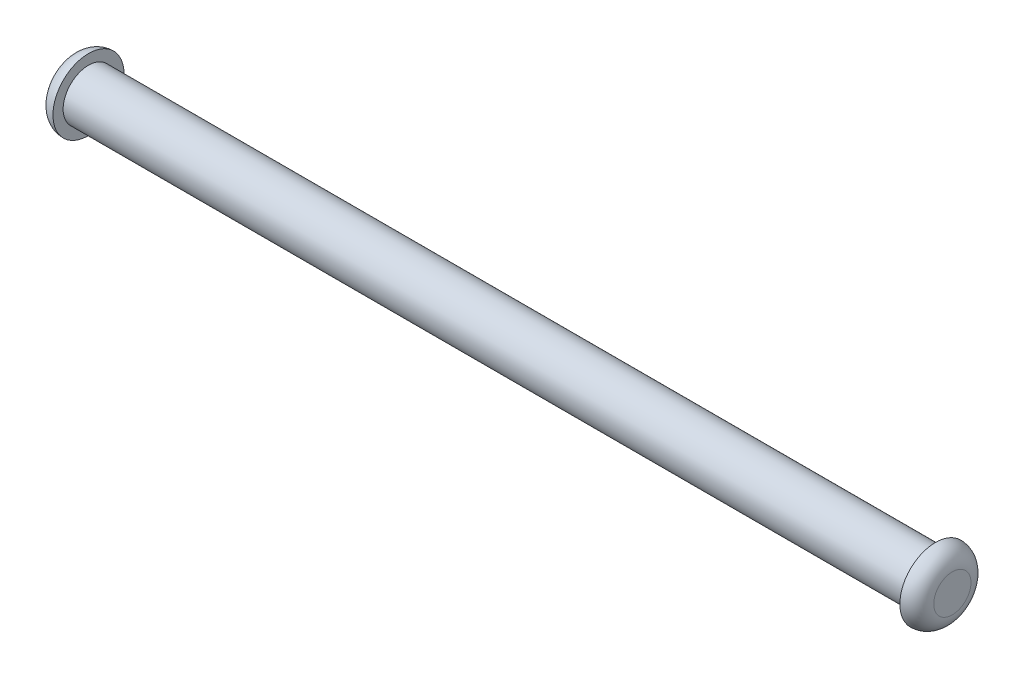
ISO-10303-21;
HEADER;
FILE_DESCRIPTION(('STEP AP214'),'2;1');
FILE_NAME('part.step','',(''),(''),'','','');
FILE_SCHEMA(('AUTOMOTIVE_DESIGN { 1 0 10303 214 1 1 1 1 }'));
ENDSEC;
DATA;
#1=APPLICATION_CONTEXT('core data for automotive mechanical design processes');
#2=APPLICATION_PROTOCOL_DEFINITION('international standard','automotive_design',2000,#1);
#3=PRODUCT_CONTEXT('',#1,'mechanical');
#4=PRODUCT('Part','Part','',(#3));
#5=PRODUCT_RELATED_PRODUCT_CATEGORY('part','',(#4));
#6=PRODUCT_DEFINITION_FORMATION('','',#4);
#7=PRODUCT_DEFINITION_CONTEXT('part definition',#1,'design');
#8=PRODUCT_DEFINITION('design','',#6,#7);
#9=PRODUCT_DEFINITION_SHAPE('','',#8);
#10=(LENGTH_UNIT() NAMED_UNIT(*) SI_UNIT(.MILLI.,.METRE.));
#11=(NAMED_UNIT(*) PLANE_ANGLE_UNIT() SI_UNIT($,.RADIAN.));
#12=(NAMED_UNIT(*) SI_UNIT($,.STERADIAN.) SOLID_ANGLE_UNIT());
#13=UNCERTAINTY_MEASURE_WITH_UNIT(LENGTH_MEASURE(1.E-05),#10,'distance_accuracy_value','');
#14=(GEOMETRIC_REPRESENTATION_CONTEXT(3) GLOBAL_UNCERTAINTY_ASSIGNED_CONTEXT((#13)) GLOBAL_UNIT_ASSIGNED_CONTEXT((#10,
#11,#12)) REPRESENTATION_CONTEXT('',''));
#15=CARTESIAN_POINT('',(0.,0.,0.));
#16=DIRECTION('',(0.,0.,1.));
#17=DIRECTION('',(1.,0.,0.));
#18=AXIS2_PLACEMENT_3D('',#15,#16,#17);
#19=CARTESIAN_POINT('',(1.,0.,0.));
#20=DIRECTION('',(1.,0.,0.));
#21=DIRECTION('',(0.,0.,-1.));
#22=AXIS2_PLACEMENT_3D('',#19,#20,#21);
#23=PLANE('',#22);
#24=CARTESIAN_POINT('',(1.,0.,0.));
#25=DIRECTION('',(1.,0.,0.));
#26=DIRECTION('',(0.,0.,-1.));
#27=AXIS2_PLACEMENT_3D('',#24,#25,#26);
#28=CIRCLE('',#27,2.1);
#29=CARTESIAN_POINT('',(1.,0.,-2.1));
#30=VERTEX_POINT('',#29);
#31=EDGE_CURVE('E42',#30,#30,#28,.T.);
#32=ORIENTED_EDGE('',*,*,#31,.T.);
#33=EDGE_LOOP('',(#32));
#34=FACE_BOUND('',#33,.T.);
#35=CARTESIAN_POINT('',(1.,0.,0.));
#36=DIRECTION('',(1.,0.,0.));
#37=DIRECTION('',(0.,0.,-1.));
#38=AXIS2_PLACEMENT_3D('',#35,#36,#37);
#39=CIRCLE('',#38,1.5);
#40=CARTESIAN_POINT('',(1.,0.,-1.5));
#41=VERTEX_POINT('',#40);
#42=EDGE_CURVE('E49',#41,#41,#39,.T.);
#43=ORIENTED_EDGE('',*,*,#42,.F.);
#44=EDGE_LOOP('',(#43));
#45=FACE_BOUND('',#44,.T.);
#46=ADVANCED_FACE('F31',(#34,#45),#23,.T.);
#47=CARTESIAN_POINT('',(0.,0.,0.));
#48=DIRECTION('',(1.,0.,0.));
#49=DIRECTION('',(0.,0.,-1.));
#50=AXIS2_PLACEMENT_3D('',#47,#48,#49);
#51=PLANE('',#50);
#52=CARTESIAN_POINT('',(0.,0.,0.));
#53=DIRECTION('',(1.,0.,0.));
#54=DIRECTION('',(0.,0.,-1.));
#55=AXIS2_PLACEMENT_3D('',#52,#53,#54);
#56=CIRCLE('',#55,1.1);
#57=CARTESIAN_POINT('',(0.,0.,-1.1));
#58=VERTEX_POINT('',#57);
#59=EDGE_CURVE('E10',#58,#58,#56,.F.);
#60=ORIENTED_EDGE('',*,*,#59,.T.);
#61=EDGE_LOOP('',(#60));
#62=FACE_BOUND('',#61,.T.);
#63=ADVANCED_FACE('F71',(#62),#51,.F.);
#64=CARTESIAN_POINT('',(51.,0.,0.));
#65=DIRECTION('',(-1.,0.,0.));
#66=DIRECTION('',(0.,0.,1.));
#67=AXIS2_PLACEMENT_3D('',#64,#65,#66);
#68=CYLINDRICAL_SURFACE('',#67,1.5);
#69=CARTESIAN_POINT('',(51.,0.,0.));
#70=DIRECTION('',(1.,0.,0.));
#71=DIRECTION('',(0.,0.,-1.));
#72=AXIS2_PLACEMENT_3D('',#69,#70,#71);
#73=CIRCLE('',#72,1.5);
#74=CARTESIAN_POINT('',(51.,0.,-1.5));
#75=VERTEX_POINT('',#74);
#76=EDGE_CURVE('E46',#75,#75,#73,.T.);
#77=ORIENTED_EDGE('',*,*,#76,.F.);
#78=EDGE_LOOP('',(#77));
#79=FACE_BOUND('',#78,.T.);
#80=ORIENTED_EDGE('',*,*,#42,.T.);
#81=EDGE_LOOP('',(#80));
#82=FACE_BOUND('',#81,.T.);
#83=ADVANCED_FACE('F65',(#79,#82),#68,.T.);
#84=CARTESIAN_POINT('',(51.,0.,0.));
#85=DIRECTION('',(1.,0.,0.));
#86=DIRECTION('',(0.,0.,-1.));
#87=AXIS2_PLACEMENT_3D('',#84,#85,#86);
#88=PLANE('',#87);
#89=CARTESIAN_POINT('',(51.,0.,0.));
#90=DIRECTION('',(1.,0.,0.));
#91=DIRECTION('',(0.,0.,-1.));
#92=AXIS2_PLACEMENT_3D('',#89,#90,#91);
#93=CIRCLE('',#92,2.1);
#94=CARTESIAN_POINT('',(51.,0.,-2.1));
#95=VERTEX_POINT('',#94);
#96=EDGE_CURVE('E52',#95,#95,#93,.T.);
#97=ORIENTED_EDGE('',*,*,#96,.F.);
#98=EDGE_LOOP('',(#97));
#99=FACE_BOUND('',#98,.T.);
#100=ORIENTED_EDGE('',*,*,#76,.T.);
#101=EDGE_LOOP('',(#100));
#102=FACE_BOUND('',#101,.T.);
#103=ADVANCED_FACE('F61',(#99,#102),#88,.F.);
#104=CARTESIAN_POINT('',(52.,0.,0.));
#105=DIRECTION('',(1.,0.,0.));
#106=DIRECTION('',(0.,0.,-1.));
#107=AXIS2_PLACEMENT_3D('',#104,#105,#106);
#108=PLANE('',#107);
#109=CARTESIAN_POINT('',(52.,0.,0.));
#110=DIRECTION('',(1.,0.,0.));
#111=DIRECTION('',(0.,0.,-1.));
#112=AXIS2_PLACEMENT_3D('',#109,#110,#111);
#113=CIRCLE('',#112,1.1);
#114=CARTESIAN_POINT('',(52.,0.,-1.1));
#115=VERTEX_POINT('',#114);
#116=EDGE_CURVE('E38',#115,#115,#113,.T.);
#117=ORIENTED_EDGE('',*,*,#116,.T.);
#118=EDGE_LOOP('',(#117));
#119=FACE_BOUND('',#118,.T.);
#120=ADVANCED_FACE('F64',(#119),#108,.T.);
#121=CARTESIAN_POINT('',(51.,0.,0.));
#122=DIRECTION('',(1.,0.,0.));
#123=DIRECTION('',(0.,0.,-1.));
#124=AXIS2_PLACEMENT_3D('',#121,#122,#123);
#125=TOROIDAL_SURFACE('',#124,1.1,1.);
#126=ORIENTED_EDGE('',*,*,#96,.T.);
#127=EDGE_LOOP('',(#126));
#128=FACE_BOUND('',#127,.T.);
#129=ORIENTED_EDGE('',*,*,#116,.F.);
#130=EDGE_LOOP('',(#129));
#131=FACE_BOUND('',#130,.T.);
#132=ADVANCED_FACE('F58',(#128,#131),#125,.T.);
#133=CARTESIAN_POINT('',(1.,0.,0.));
#134=DIRECTION('',(1.,0.,0.));
#135=DIRECTION('',(0.,0.,-1.));
#136=AXIS2_PLACEMENT_3D('',#133,#134,#135);
#137=TOROIDAL_SURFACE('',#136,1.1,1.);
#138=ORIENTED_EDGE('',*,*,#59,.F.);
#139=EDGE_LOOP('',(#138));
#140=FACE_BOUND('',#139,.T.);
#141=ORIENTED_EDGE('',*,*,#31,.F.);
#142=EDGE_LOOP('',(#141));
#143=FACE_BOUND('',#142,.T.);
#144=ADVANCED_FACE('F33',(#140,#143),#137,.T.);
#145=CLOSED_SHELL('',(#46,#63,#83,#103,#120,#132,#144));
#146=MANIFOLD_SOLID_BREP('B2',#145);
#147=ADVANCED_BREP_SHAPE_REPRESENTATION('',(#18,#146),#14);
#148=SHAPE_DEFINITION_REPRESENTATION(#9,#147);
ENDSEC;
END-ISO-10303-21;
